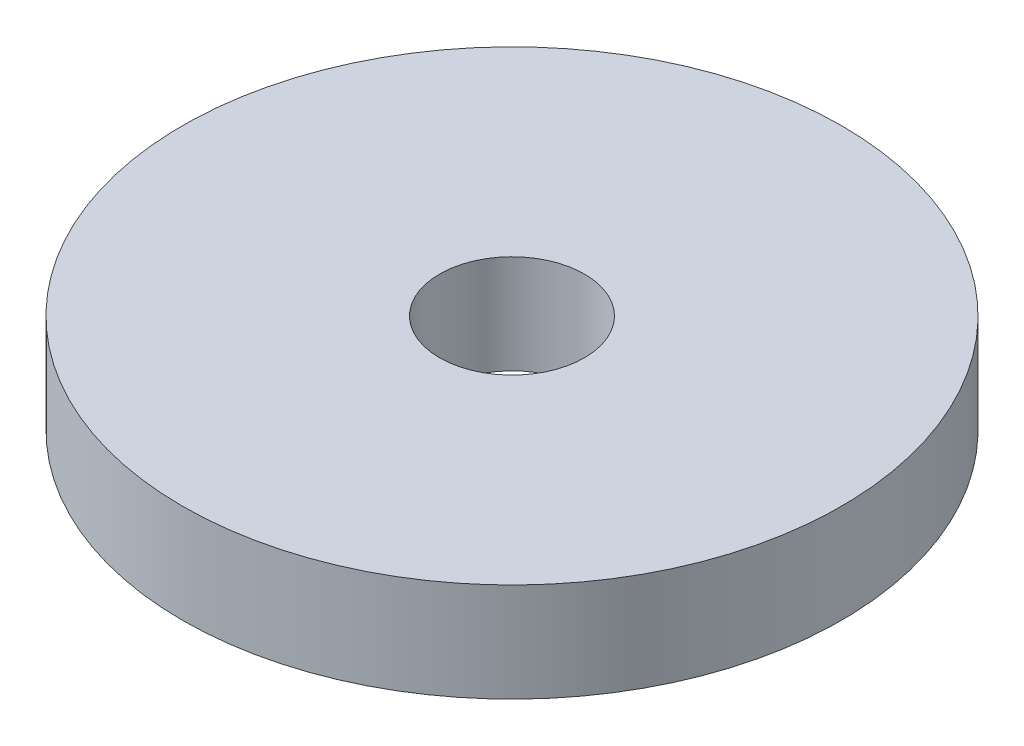
ISO-10303-21;
HEADER;
FILE_DESCRIPTION(('STEP AP214'),'2;1');
FILE_NAME('part.step','',(''),(''),'','','');
FILE_SCHEMA(('AUTOMOTIVE_DESIGN { 1 0 10303 214 1 1 1 1 }'));
ENDSEC;
DATA;
#1=APPLICATION_CONTEXT('core data for automotive mechanical design processes');
#2=APPLICATION_PROTOCOL_DEFINITION('international standard','automotive_design',2000,#1);
#3=PRODUCT_CONTEXT('',#1,'mechanical');
#4=PRODUCT('Part','Part','',(#3));
#5=PRODUCT_RELATED_PRODUCT_CATEGORY('part','',(#4));
#6=PRODUCT_DEFINITION_FORMATION('','',#4);
#7=PRODUCT_DEFINITION_CONTEXT('part definition',#1,'design');
#8=PRODUCT_DEFINITION('design','',#6,#7);
#9=PRODUCT_DEFINITION_SHAPE('','',#8);
#10=(LENGTH_UNIT() NAMED_UNIT(*) SI_UNIT(.MILLI.,.METRE.));
#11=(NAMED_UNIT(*) PLANE_ANGLE_UNIT() SI_UNIT($,.RADIAN.));
#12=(NAMED_UNIT(*) SI_UNIT($,.STERADIAN.) SOLID_ANGLE_UNIT());
#13=UNCERTAINTY_MEASURE_WITH_UNIT(LENGTH_MEASURE(1.E-05),#10,'distance_accuracy_value','');
#14=(GEOMETRIC_REPRESENTATION_CONTEXT(3) GLOBAL_UNCERTAINTY_ASSIGNED_CONTEXT((#13)) GLOBAL_UNIT_ASSIGNED_CONTEXT((#10,
#11,#12)) REPRESENTATION_CONTEXT('',''));
#15=CARTESIAN_POINT('',(0.,0.,0.));
#16=DIRECTION('',(0.,0.,1.));
#17=DIRECTION('',(1.,0.,0.));
#18=AXIS2_PLACEMENT_3D('',#15,#16,#17);
#19=CARTESIAN_POINT('',(0.,1.5,0.));
#20=DIRECTION('',(0.,1.,0.));
#21=DIRECTION('',(0.,0.,1.));
#22=AXIS2_PLACEMENT_3D('',#19,#20,#21);
#23=PLANE('',#22);
#24=CARTESIAN_POINT('',(0.,1.5,0.));
#25=DIRECTION('',(0.,1.,0.));
#26=DIRECTION('',(0.,0.,1.));
#27=AXIS2_PLACEMENT_3D('',#24,#25,#26);
#28=CIRCLE('',#27,5.);
#29=CARTESIAN_POINT('',(0.,1.5,5.));
#30=VERTEX_POINT('',#29);
#31=EDGE_CURVE('E10',#30,#30,#28,.T.);
#32=ORIENTED_EDGE('',*,*,#31,.T.);
#33=EDGE_LOOP('',(#32));
#34=FACE_BOUND('',#33,.T.);
#35=CARTESIAN_POINT('',(0.,1.5,0.));
#36=DIRECTION('',(0.,1.,0.));
#37=DIRECTION('',(0.,0.,1.));
#38=AXIS2_PLACEMENT_3D('',#35,#36,#37);
#39=CIRCLE('',#38,1.1);
#40=CARTESIAN_POINT('',(0.,1.5,1.1));
#41=VERTEX_POINT('',#40);
#42=EDGE_CURVE('E42',#41,#41,#39,.T.);
#43=ORIENTED_EDGE('',*,*,#42,.F.);
#44=EDGE_LOOP('',(#43));
#45=FACE_BOUND('',#44,.T.);
#46=ADVANCED_FACE('F31',(#34,#45),#23,.T.);
#47=CARTESIAN_POINT('',(0.,0.,0.));
#48=DIRECTION('',(0.,1.,0.));
#49=DIRECTION('',(0.,0.,1.));
#50=AXIS2_PLACEMENT_3D('',#47,#48,#49);
#51=PLANE('',#50);
#52=CARTESIAN_POINT('',(0.,0.,0.));
#53=DIRECTION('',(0.,1.,0.));
#54=DIRECTION('',(0.,0.,1.));
#55=AXIS2_PLACEMENT_3D('',#52,#53,#54);
#56=CIRCLE('',#55,5.);
#57=CARTESIAN_POINT('',(0.,0.,5.));
#58=VERTEX_POINT('',#57);
#59=EDGE_CURVE('E35',#58,#58,#56,.T.);
#60=ORIENTED_EDGE('',*,*,#59,.F.);
#61=EDGE_LOOP('',(#60));
#62=FACE_BOUND('',#61,.T.);
#63=CARTESIAN_POINT('',(0.,0.,0.));
#64=DIRECTION('',(0.,1.,0.));
#65=DIRECTION('',(0.,0.,1.));
#66=AXIS2_PLACEMENT_3D('',#63,#64,#65);
#67=CIRCLE('',#66,1.1);
#68=CARTESIAN_POINT('',(0.,0.,1.1));
#69=VERTEX_POINT('',#68);
#70=EDGE_CURVE('E44',#69,#69,#67,.T.);
#71=ORIENTED_EDGE('',*,*,#70,.T.);
#72=EDGE_LOOP('',(#71));
#73=FACE_BOUND('',#72,.T.);
#74=ADVANCED_FACE('F54',(#62,#73),#51,.F.);
#75=CARTESIAN_POINT('',(0.,1.5,0.));
#76=DIRECTION('',(0.,-1.,0.));
#77=DIRECTION('',(0.,0.,-1.));
#78=AXIS2_PLACEMENT_3D('',#75,#76,#77);
#79=CYLINDRICAL_SURFACE('',#78,5.);
#80=ORIENTED_EDGE('',*,*,#31,.F.);
#81=EDGE_LOOP('',(#80));
#82=FACE_BOUND('',#81,.T.);
#83=ORIENTED_EDGE('',*,*,#59,.T.);
#84=EDGE_LOOP('',(#83));
#85=FACE_BOUND('',#84,.T.);
#86=ADVANCED_FACE('F33',(#82,#85),#79,.T.);
#87=CARTESIAN_POINT('',(0.,1.5,0.));
#88=DIRECTION('',(0.,-1.,0.));
#89=DIRECTION('',(0.,0.,-1.));
#90=AXIS2_PLACEMENT_3D('',#87,#88,#89);
#91=CYLINDRICAL_SURFACE('',#90,1.1);
#92=ORIENTED_EDGE('',*,*,#42,.T.);
#93=EDGE_LOOP('',(#92));
#94=FACE_BOUND('',#93,.T.);
#95=ORIENTED_EDGE('',*,*,#70,.F.);
#96=EDGE_LOOP('',(#95));
#97=FACE_BOUND('',#96,.T.);
#98=ADVANCED_FACE('F50',(#94,#97),#91,.F.);
#99=CLOSED_SHELL('',(#46,#74,#86,#98));
#100=MANIFOLD_SOLID_BREP('B2',#99);
#101=ADVANCED_BREP_SHAPE_REPRESENTATION('',(#18,#100),#14);
#102=SHAPE_DEFINITION_REPRESENTATION(#9,#101);
ENDSEC;
END-ISO-10303-21;
